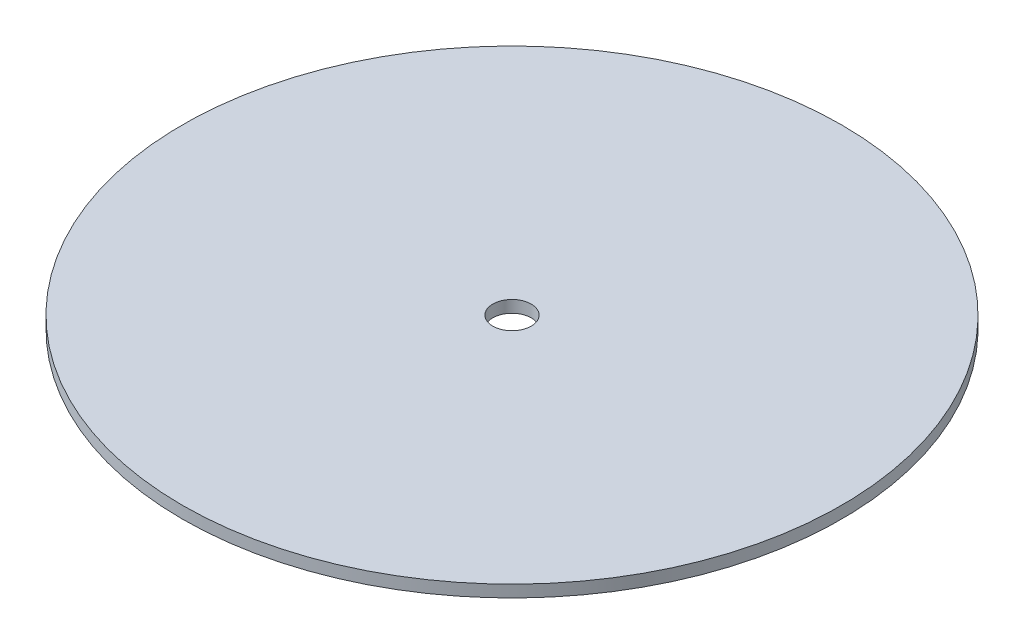
ISO-10303-21;
HEADER;
FILE_DESCRIPTION(('STEP AP214'),'2;1');
FILE_NAME('part.step','',(''),(''),'','','');
FILE_SCHEMA(('AUTOMOTIVE_DESIGN { 1 0 10303 214 1 1 1 1 }'));
ENDSEC;
DATA;
#1=APPLICATION_CONTEXT('core data for automotive mechanical design processes');
#2=APPLICATION_PROTOCOL_DEFINITION('international standard','automotive_design',2000,#1);
#3=PRODUCT_CONTEXT('',#1,'mechanical');
#4=PRODUCT('Part','Part','',(#3));
#5=PRODUCT_RELATED_PRODUCT_CATEGORY('part','',(#4));
#6=PRODUCT_DEFINITION_FORMATION('','',#4);
#7=PRODUCT_DEFINITION_CONTEXT('part definition',#1,'design');
#8=PRODUCT_DEFINITION('design','',#6,#7);
#9=PRODUCT_DEFINITION_SHAPE('','',#8);
#10=(LENGTH_UNIT() NAMED_UNIT(*) SI_UNIT(.MILLI.,.METRE.));
#11=(NAMED_UNIT(*) PLANE_ANGLE_UNIT() SI_UNIT($,.RADIAN.));
#12=(NAMED_UNIT(*) SI_UNIT($,.STERADIAN.) SOLID_ANGLE_UNIT());
#13=UNCERTAINTY_MEASURE_WITH_UNIT(LENGTH_MEASURE(1.E-05),#10,'distance_accuracy_value','');
#14=(GEOMETRIC_REPRESENTATION_CONTEXT(3) GLOBAL_UNCERTAINTY_ASSIGNED_CONTEXT((#13)) GLOBAL_UNIT_ASSIGNED_CONTEXT((#10,
#11,#12)) REPRESENTATION_CONTEXT('',''));
#15=CARTESIAN_POINT('',(0.,0.,0.));
#16=DIRECTION('',(0.,0.,1.));
#17=DIRECTION('',(1.,0.,0.));
#18=AXIS2_PLACEMENT_3D('',#15,#16,#17);
#19=CARTESIAN_POINT('',(0.,5.,0.));
#20=DIRECTION('',(0.,-1.,0.));
#21=DIRECTION('',(0.,0.,-1.));
#22=AXIS2_PLACEMENT_3D('',#19,#20,#21);
#23=CYLINDRICAL_SURFACE('',#22,137.5);
#24=CARTESIAN_POINT('',(0.,5.,0.));
#25=DIRECTION('',(0.,1.,0.));
#26=DIRECTION('',(0.,0.,1.));
#27=AXIS2_PLACEMENT_3D('',#24,#25,#26);
#28=CIRCLE('',#27,137.5);
#29=CARTESIAN_POINT('',(0.,5.,137.5));
#30=VERTEX_POINT('',#29);
#31=EDGE_CURVE('E12',#30,#30,#28,.T.);
#32=ORIENTED_EDGE('',*,*,#31,.F.);
#33=EDGE_LOOP('',(#32));
#34=FACE_BOUND('',#33,.T.);
#35=CARTESIAN_POINT('',(0.,0.,0.));
#36=DIRECTION('',(0.,1.,0.));
#37=DIRECTION('',(0.,0.,1.));
#38=AXIS2_PLACEMENT_3D('',#35,#36,#37);
#39=CIRCLE('',#38,137.5);
#40=CARTESIAN_POINT('',(0.,0.,137.5));
#41=VERTEX_POINT('',#40);
#42=EDGE_CURVE('E49',#41,#41,#39,.T.);
#43=ORIENTED_EDGE('',*,*,#42,.T.);
#44=EDGE_LOOP('',(#43));
#45=FACE_BOUND('',#44,.T.);
#46=ADVANCED_FACE('F46',(#34,#45),#23,.T.);
#47=CARTESIAN_POINT('',(0.,5.,0.));
#48=DIRECTION('',(0.,1.,0.));
#49=DIRECTION('',(0.,0.,1.));
#50=AXIS2_PLACEMENT_3D('',#47,#48,#49);
#51=PLANE('',#50);
#52=CARTESIAN_POINT('',(0.,5.,0.));
#53=DIRECTION('',(0.,1.,0.));
#54=DIRECTION('',(0.,0.,1.));
#55=AXIS2_PLACEMENT_3D('',#52,#53,#54);
#56=CIRCLE('',#55,8.);
#57=CARTESIAN_POINT('',(0.,5.,8.));
#58=VERTEX_POINT('',#57);
#59=EDGE_CURVE('E58',#58,#58,#56,.T.);
#60=ORIENTED_EDGE('',*,*,#59,.F.);
#61=EDGE_LOOP('',(#60));
#62=FACE_BOUND('',#61,.T.);
#63=ORIENTED_EDGE('',*,*,#31,.T.);
#64=EDGE_LOOP('',(#63));
#65=FACE_BOUND('',#64,.T.);
#66=ADVANCED_FACE('F73',(#62,#65),#51,.T.);
#67=CARTESIAN_POINT('',(0.,0.,0.));
#68=DIRECTION('',(0.,1.,0.));
#69=DIRECTION('',(0.,0.,1.));
#70=AXIS2_PLACEMENT_3D('',#67,#68,#69);
#71=PLANE('',#70);
#72=CARTESIAN_POINT('',(0.,0.,0.));
#73=DIRECTION('',(0.,1.,0.));
#74=DIRECTION('',(0.,0.,1.));
#75=AXIS2_PLACEMENT_3D('',#72,#73,#74);
#76=CIRCLE('',#75,8.);
#77=CARTESIAN_POINT('',(0.,0.,8.));
#78=VERTEX_POINT('',#77);
#79=EDGE_CURVE('E56',#78,#78,#76,.T.);
#80=ORIENTED_EDGE('',*,*,#79,.T.);
#81=EDGE_LOOP('',(#80));
#82=FACE_BOUND('',#81,.T.);
#83=ORIENTED_EDGE('',*,*,#42,.F.);
#84=EDGE_LOOP('',(#83));
#85=FACE_BOUND('',#84,.T.);
#86=ADVANCED_FACE('F64',(#82,#85),#71,.F.);
#87=CARTESIAN_POINT('',(0.,0.,0.));
#88=DIRECTION('',(0.,1.,0.));
#89=DIRECTION('',(0.,0.,1.));
#90=AXIS2_PLACEMENT_3D('',#87,#88,#89);
#91=CYLINDRICAL_SURFACE('',#90,8.);
#92=ORIENTED_EDGE('',*,*,#79,.F.);
#93=EDGE_LOOP('',(#92));
#94=FACE_BOUND('',#93,.T.);
#95=ORIENTED_EDGE('',*,*,#59,.T.);
#96=EDGE_LOOP('',(#95));
#97=FACE_BOUND('',#96,.T.);
#98=ADVANCED_FACE('F67',(#94,#97),#91,.F.);
#99=CLOSED_SHELL('',(#46,#66,#86,#98));
#100=MANIFOLD_SOLID_BREP('B2',#99);
#101=ADVANCED_BREP_SHAPE_REPRESENTATION('',(#18,#100),#14);
#102=SHAPE_DEFINITION_REPRESENTATION(#9,#101);
ENDSEC;
END-ISO-10303-21;
